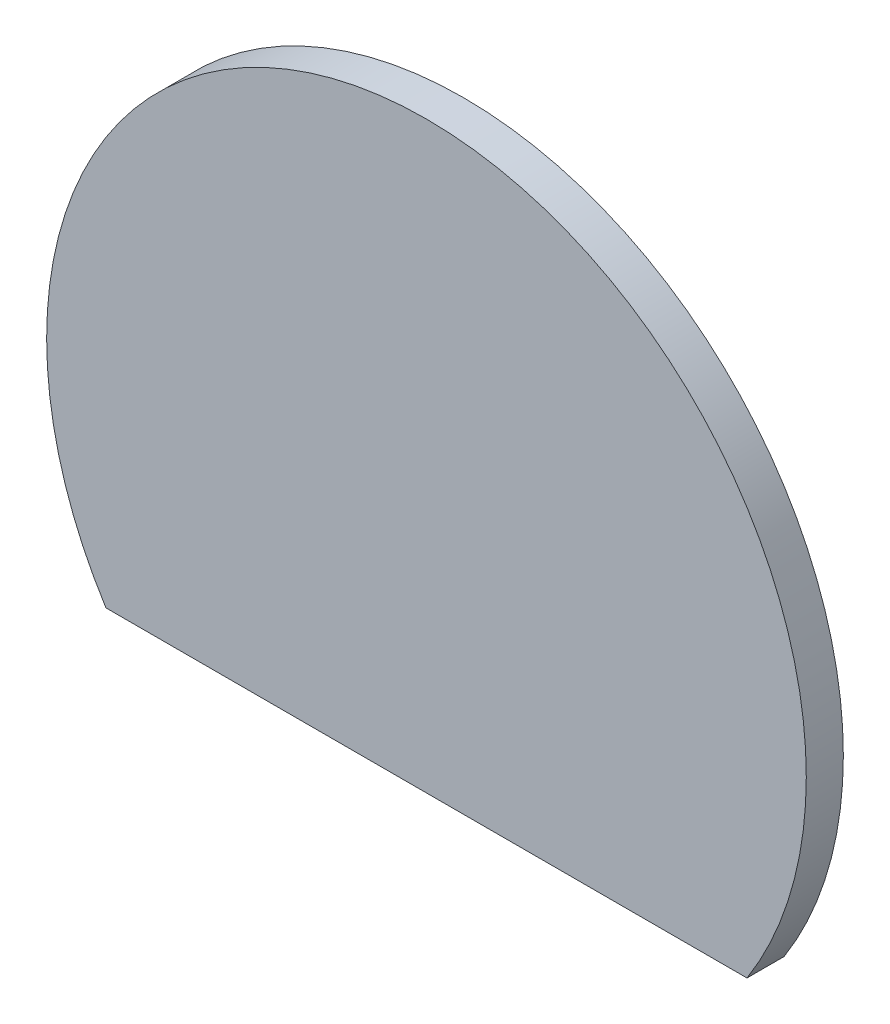
ISO-10303-21;
HEADER;
FILE_DESCRIPTION(('STEP AP214'),'2;1');
FILE_NAME('part.step','',(''),(''),'','','');
FILE_SCHEMA(('AUTOMOTIVE_DESIGN { 1 0 10303 214 1 1 1 1 }'));
ENDSEC;
DATA;
#1=APPLICATION_CONTEXT('core data for automotive mechanical design processes');
#2=APPLICATION_PROTOCOL_DEFINITION('international standard','automotive_design',2000,#1);
#3=PRODUCT_CONTEXT('',#1,'mechanical');
#4=PRODUCT('Part','Part','',(#3));
#5=PRODUCT_RELATED_PRODUCT_CATEGORY('part','',(#4));
#6=PRODUCT_DEFINITION_FORMATION('','',#4);
#7=PRODUCT_DEFINITION_CONTEXT('part definition',#1,'design');
#8=PRODUCT_DEFINITION('design','',#6,#7);
#9=PRODUCT_DEFINITION_SHAPE('','',#8);
#10=(LENGTH_UNIT() NAMED_UNIT(*) SI_UNIT(.MILLI.,.METRE.));
#11=(NAMED_UNIT(*) PLANE_ANGLE_UNIT() SI_UNIT($,.RADIAN.));
#12=(NAMED_UNIT(*) SI_UNIT($,.STERADIAN.) SOLID_ANGLE_UNIT());
#13=UNCERTAINTY_MEASURE_WITH_UNIT(LENGTH_MEASURE(1.E-05),#10,'distance_accuracy_value','');
#14=(GEOMETRIC_REPRESENTATION_CONTEXT(3) GLOBAL_UNCERTAINTY_ASSIGNED_CONTEXT((#13)) GLOBAL_UNIT_ASSIGNED_CONTEXT((#10,
#11,#12)) REPRESENTATION_CONTEXT('',''));
#15=CARTESIAN_POINT('',(0.,0.,0.));
#16=DIRECTION('',(0.,0.,1.));
#17=DIRECTION('',(1.,0.,0.));
#18=AXIS2_PLACEMENT_3D('',#15,#16,#17);
#19=CARTESIAN_POINT('',(0.,-5.5,1.));
#20=DIRECTION('',(0.,1.,0.));
#21=DIRECTION('',(0.,0.,1.));
#22=AXIS2_PLACEMENT_3D('',#19,#20,#21);
#23=PLANE('',#22);
#24=DIRECTION('',(1.,0.,0.));
#25=VECTOR('',#24,1.);
#26=CARTESIAN_POINT('',(0.,-5.5,0.));
#27=LINE('',#26,#25);
#28=CARTESIAN_POINT('',(-8.64942194600309,-5.5,0.));
#29=VERTEX_POINT('',#28);
#30=CARTESIAN_POINT('',(0.,-5.5,0.));
#31=VERTEX_POINT('',#30);
#32=EDGE_CURVE('E96',#29,#31,#27,.T.);
#33=ORIENTED_EDGE('',*,*,#32,.T.);
#34=CARTESIAN_POINT('',(8.64942194600309,-5.5,0.));
#35=VERTEX_POINT('',#34);
#36=EDGE_CURVE('E103',#31,#35,#27,.T.);
#37=ORIENTED_EDGE('',*,*,#36,.T.);
#38=DIRECTION('',(0.,0.,-1.));
#39=VECTOR('',#38,1.);
#40=CARTESIAN_POINT('',(8.64942194600309,-5.5,1.));
#41=LINE('',#40,#39);
#42=CARTESIAN_POINT('',(8.64942194600309,-5.5,1.));
#43=VERTEX_POINT('',#42);
#44=EDGE_CURVE('E56',#43,#35,#41,.T.);
#45=ORIENTED_EDGE('',*,*,#44,.F.);
#46=DIRECTION('',(1.,0.,0.));
#47=VECTOR('',#46,1.);
#48=CARTESIAN_POINT('',(0.,-5.5,1.));
#49=LINE('',#48,#47);
#50=CARTESIAN_POINT('',(-8.64942194600309,-5.5,1.));
#51=VERTEX_POINT('',#50);
#52=EDGE_CURVE('E95',#51,#43,#49,.T.);
#53=ORIENTED_EDGE('',*,*,#52,.F.);
#54=DIRECTION('',(0.,0.,-1.));
#55=VECTOR('',#54,1.);
#56=CARTESIAN_POINT('',(-8.64942194600309,-5.5,1.));
#57=LINE('',#56,#55);
#58=EDGE_CURVE('E88',#51,#29,#57,.T.);
#59=ORIENTED_EDGE('',*,*,#58,.T.);
#60=EDGE_LOOP('',(#33,#37,#45,#53,#59));
#61=FACE_BOUND('',#60,.T.);
#62=ADVANCED_FACE('F53',(#61),#23,.F.);
#63=CARTESIAN_POINT('',(0.,0.,1.));
#64=DIRECTION('',(0.,0.,-1.));
#65=DIRECTION('',(-1.,0.,0.));
#66=AXIS2_PLACEMENT_3D('',#63,#64,#65);
#67=CYLINDRICAL_SURFACE('',#66,10.25);
#68=CARTESIAN_POINT('',(0.,0.,0.));
#69=DIRECTION('',(0.,0.,1.));
#70=DIRECTION('',(1.,0.,0.));
#71=AXIS2_PLACEMENT_3D('',#68,#69,#70);
#72=CIRCLE('',#71,10.25);
#73=EDGE_CURVE('E85',#35,#29,#72,.T.);
#74=ORIENTED_EDGE('',*,*,#73,.T.);
#75=ORIENTED_EDGE('',*,*,#58,.F.);
#76=CARTESIAN_POINT('',(0.,0.,1.));
#77=DIRECTION('',(0.,0.,1.));
#78=DIRECTION('',(1.,0.,0.));
#79=AXIS2_PLACEMENT_3D('',#76,#77,#78);
#80=CIRCLE('',#79,10.25);
#81=EDGE_CURVE('E74',#43,#51,#80,.T.);
#82=ORIENTED_EDGE('',*,*,#81,.F.);
#83=ORIENTED_EDGE('',*,*,#44,.T.);
#84=EDGE_LOOP('',(#74,#75,#82,#83));
#85=FACE_BOUND('',#84,.T.);
#86=ADVANCED_FACE('F87',(#85),#67,.T.);
#87=CARTESIAN_POINT('',(0.,0.,1.));
#88=DIRECTION('',(0.,0.,1.));
#89=DIRECTION('',(1.,0.,0.));
#90=AXIS2_PLACEMENT_3D('',#87,#88,#89);
#91=PLANE('',#90);
#92=ORIENTED_EDGE('',*,*,#52,.T.);
#93=ORIENTED_EDGE('',*,*,#81,.T.);
#94=EDGE_LOOP('',(#92,#93));
#95=FACE_BOUND('',#94,.T.);
#96=ADVANCED_FACE('F139',(#95),#91,.T.);
#97=CARTESIAN_POINT('',(0.,0.,0.));
#98=DIRECTION('',(0.,0.,1.));
#99=DIRECTION('',(1.,0.,0.));
#100=AXIS2_PLACEMENT_3D('',#97,#98,#99);
#101=PLANE('',#100);
#102=ORIENTED_EDGE('',*,*,#36,.F.);
#103=CARTESIAN_POINT('',(0.,0.,0.));
#104=DIRECTION('',(0.,0.,1.));
#105=DIRECTION('',(1.,0.,0.));
#106=AXIS2_PLACEMENT_3D('',#103,#104,#105);
#107=CIRCLE('',#106,5.5);
#108=EDGE_CURVE('E67',#31,#31,#107,.T.);
#109=ORIENTED_EDGE('',*,*,#108,.T.);
#110=ORIENTED_EDGE('',*,*,#32,.F.);
#111=ORIENTED_EDGE('',*,*,#73,.F.);
#112=EDGE_LOOP('',(#102,#109,#110,#111));
#113=FACE_BOUND('',#112,.T.);
#114=ADVANCED_FACE('F101',(#113),#101,.F.);
#115=CARTESIAN_POINT('',(0.,0.,-2.));
#116=DIRECTION('',(0.,0.,1.));
#117=DIRECTION('',(1.,0.,0.));
#118=AXIS2_PLACEMENT_3D('',#115,#116,#117);
#119=CYLINDRICAL_SURFACE('',#118,5.5);
#120=CARTESIAN_POINT('',(0.,0.,-2.));
#121=DIRECTION('',(0.,0.,1.));
#122=DIRECTION('',(1.,0.,0.));
#123=AXIS2_PLACEMENT_3D('',#120,#121,#122);
#124=CIRCLE('',#123,5.5);
#125=CARTESIAN_POINT('',(5.5,0.,-2.));
#126=VERTEX_POINT('',#125);
#127=EDGE_CURVE('E106',#126,#126,#124,.T.);
#128=ORIENTED_EDGE('',*,*,#127,.T.);
#129=EDGE_LOOP('',(#128));
#130=FACE_BOUND('',#129,.T.);
#131=ORIENTED_EDGE('',*,*,#108,.F.);
#132=EDGE_LOOP('',(#131));
#133=FACE_BOUND('',#132,.T.);
#134=ADVANCED_FACE('F138',(#130,#133),#119,.T.);
#135=CARTESIAN_POINT('',(0.,0.,-2.));
#136=DIRECTION('',(0.,0.,1.));
#137=DIRECTION('',(1.,0.,0.));
#138=AXIS2_PLACEMENT_3D('',#135,#136,#137);
#139=PLANE('',#138);
#140=CARTESIAN_POINT('',(0.,0.,-2.));
#141=DIRECTION('',(0.,0.,1.));
#142=DIRECTION('',(1.,0.,0.));
#143=AXIS2_PLACEMENT_3D('',#140,#141,#142);
#144=CIRCLE('',#143,4.5);
#145=CARTESIAN_POINT('',(4.5,0.,-2.));
#146=VERTEX_POINT('',#145);
#147=EDGE_CURVE('E114',#146,#146,#144,.T.);
#148=ORIENTED_EDGE('',*,*,#147,.T.);
#149=EDGE_LOOP('',(#148));
#150=FACE_BOUND('',#149,.T.);
#151=ORIENTED_EDGE('',*,*,#127,.F.);
#152=EDGE_LOOP('',(#151));
#153=FACE_BOUND('',#152,.T.);
#154=ADVANCED_FACE('F122',(#150,#153),#139,.F.);
#155=CARTESIAN_POINT('',(0.,0.,-2.));
#156=DIRECTION('',(0.,0.,1.));
#157=DIRECTION('',(1.,0.,0.));
#158=AXIS2_PLACEMENT_3D('',#155,#156,#157);
#159=CYLINDRICAL_SURFACE('',#158,4.5);
#160=ORIENTED_EDGE('',*,*,#147,.F.);
#161=EDGE_LOOP('',(#160));
#162=FACE_BOUND('',#161,.T.);
#163=CARTESIAN_POINT('',(0.,0.,0.));
#164=DIRECTION('',(0.,0.,1.));
#165=DIRECTION('',(1.,0.,0.));
#166=AXIS2_PLACEMENT_3D('',#163,#164,#165);
#167=CIRCLE('',#166,4.5);
#168=CARTESIAN_POINT('',(4.5,0.,0.));
#169=VERTEX_POINT('',#168);
#170=EDGE_CURVE('E12',#169,#169,#167,.T.);
#171=ORIENTED_EDGE('',*,*,#170,.T.);
#172=EDGE_LOOP('',(#171));
#173=FACE_BOUND('',#172,.T.);
#174=ADVANCED_FACE('F125',(#162,#173),#159,.F.);
#175=ORIENTED_EDGE('',*,*,#170,.F.);
#176=EDGE_LOOP('',(#175));
#177=FACE_BOUND('',#176,.T.);
#178=ADVANCED_FACE('F128',(#177),#101,.F.);
#179=CLOSED_SHELL('',(#62,#86,#96,#114,#134,#154,#174,#178));
#180=MANIFOLD_SOLID_BREP('B2',#179);
#181=ADVANCED_BREP_SHAPE_REPRESENTATION('',(#18,#180),#14);
#182=SHAPE_DEFINITION_REPRESENTATION(#9,#181);
ENDSEC;
END-ISO-10303-21;
